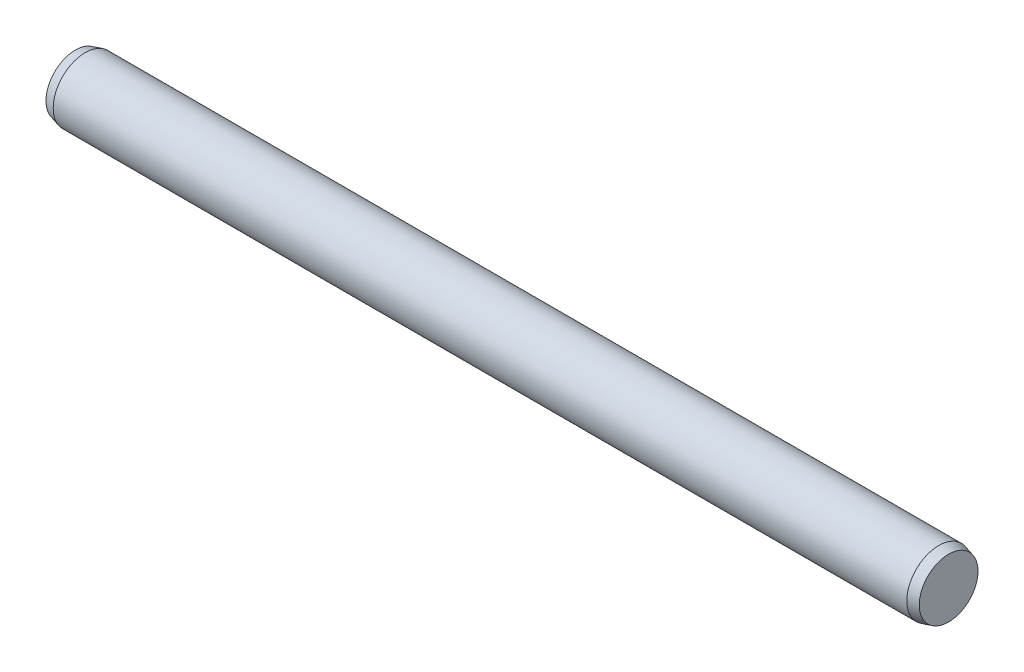
ISO-10303-21;
HEADER;
FILE_DESCRIPTION(('STEP AP214'),'2;1');
FILE_NAME('part.step','',(''),(''),'','','');
FILE_SCHEMA(('AUTOMOTIVE_DESIGN { 1 0 10303 214 1 1 1 1 }'));
ENDSEC;
DATA;
#1=APPLICATION_CONTEXT('core data for automotive mechanical design processes');
#2=APPLICATION_PROTOCOL_DEFINITION('international standard','automotive_design',2000,#1);
#3=PRODUCT_CONTEXT('',#1,'mechanical');
#4=PRODUCT('Part','Part','',(#3));
#5=PRODUCT_RELATED_PRODUCT_CATEGORY('part','',(#4));
#6=PRODUCT_DEFINITION_FORMATION('','',#4);
#7=PRODUCT_DEFINITION_CONTEXT('part definition',#1,'design');
#8=PRODUCT_DEFINITION('design','',#6,#7);
#9=PRODUCT_DEFINITION_SHAPE('','',#8);
#10=(LENGTH_UNIT() NAMED_UNIT(*) SI_UNIT(.MILLI.,.METRE.));
#11=(NAMED_UNIT(*) PLANE_ANGLE_UNIT() SI_UNIT($,.RADIAN.));
#12=(NAMED_UNIT(*) SI_UNIT($,.STERADIAN.) SOLID_ANGLE_UNIT());
#13=UNCERTAINTY_MEASURE_WITH_UNIT(LENGTH_MEASURE(1.E-05),#10,'distance_accuracy_value','');
#14=(GEOMETRIC_REPRESENTATION_CONTEXT(3) GLOBAL_UNCERTAINTY_ASSIGNED_CONTEXT((#13)) GLOBAL_UNIT_ASSIGNED_CONTEXT((#10,
#11,#12)) REPRESENTATION_CONTEXT('',''));
#15=CARTESIAN_POINT('',(0.,0.,0.));
#16=DIRECTION('',(0.,0.,1.));
#17=DIRECTION('',(1.,0.,0.));
#18=AXIS2_PLACEMENT_3D('',#15,#16,#17);
#19=CARTESIAN_POINT('',(-10.,0.,0.));
#20=DIRECTION('',(1.,0.,0.));
#21=DIRECTION('',(0.,0.,-1.));
#22=AXIS2_PLACEMENT_3D('',#19,#20,#21);
#23=CYLINDRICAL_SURFACE('',#22,0.750000000000002);
#24=CARTESIAN_POINT('',(-10.,0.,0.));
#25=DIRECTION('',(-1.,0.,0.));
#26=DIRECTION('',(0.,0.,1.));
#27=AXIS2_PLACEMENT_3D('',#24,#25,#26);
#28=CIRCLE('',#27,0.750000000000002);
#29=CARTESIAN_POINT('',(-10.,0.,0.750000000000002));
#30=VERTEX_POINT('',#29);
#31=EDGE_CURVE('E44',#30,#30,#28,.T.);
#32=ORIENTED_EDGE('',*,*,#31,.F.);
#33=EDGE_LOOP('',(#32));
#34=FACE_BOUND('',#33,.T.);
#35=CARTESIAN_POINT('',(10.,0.,0.));
#36=DIRECTION('',(1.,0.,0.));
#37=DIRECTION('',(0.,0.,-1.));
#38=AXIS2_PLACEMENT_3D('',#35,#36,#37);
#39=CIRCLE('',#38,0.750000000000002);
#40=CARTESIAN_POINT('',(10.,0.,-0.750000000000002));
#41=VERTEX_POINT('',#40);
#42=EDGE_CURVE('E10',#41,#41,#39,.T.);
#43=ORIENTED_EDGE('',*,*,#42,.F.);
#44=EDGE_LOOP('',(#43));
#45=FACE_BOUND('',#44,.T.);
#46=ADVANCED_FACE('F30',(#34,#45),#23,.T.);
#47=CARTESIAN_POINT('',(10.,0.,0.));
#48=DIRECTION('',(-1.,0.,0.));
#49=DIRECTION('',(0.,0.,-1.));
#50=AXIS2_PLACEMENT_3D('',#47,#48,#49);
#51=CONICAL_SURFACE('',#50,0.750000000000002,0.26179938779915);
#52=CARTESIAN_POINT('',(10.23,0.,0.));
#53=DIRECTION('',(1.,0.,0.));
#54=DIRECTION('',(0.,0.,-1.));
#55=AXIS2_PLACEMENT_3D('',#52,#53,#54);
#56=CIRCLE('',#55,0.688371685740845);
#57=CARTESIAN_POINT('',(10.23,0.,-0.688371685740845));
#58=VERTEX_POINT('',#57);
#59=EDGE_CURVE('E36',#58,#58,#56,.T.);
#60=ORIENTED_EDGE('',*,*,#59,.F.);
#61=EDGE_LOOP('',(#60));
#62=FACE_BOUND('',#61,.T.);
#63=ORIENTED_EDGE('',*,*,#42,.T.);
#64=EDGE_LOOP('',(#63));
#65=FACE_BOUND('',#64,.T.);
#66=ADVANCED_FACE('F54',(#62,#65),#51,.T.);
#67=CARTESIAN_POINT('',(10.23,0.,0.));
#68=DIRECTION('',(1.,0.,0.));
#69=DIRECTION('',(0.,0.,-1.));
#70=AXIS2_PLACEMENT_3D('',#67,#68,#69);
#71=PLANE('',#70);
#72=ORIENTED_EDGE('',*,*,#59,.T.);
#73=EDGE_LOOP('',(#72));
#74=FACE_BOUND('',#73,.T.);
#75=ADVANCED_FACE('F58',(#74),#71,.T.);
#76=CARTESIAN_POINT('',(-10.,0.,0.));
#77=DIRECTION('',(1.,0.,0.));
#78=DIRECTION('',(0.,0.,1.));
#79=AXIS2_PLACEMENT_3D('',#76,#77,#78);
#80=CONICAL_SURFACE('',#79,0.750000000000002,0.26179938779915);
#81=CARTESIAN_POINT('',(-10.23,0.,0.));
#82=DIRECTION('',(-1.,0.,0.));
#83=DIRECTION('',(0.,0.,1.));
#84=AXIS2_PLACEMENT_3D('',#81,#82,#83);
#85=CIRCLE('',#84,0.688371685740845);
#86=CARTESIAN_POINT('',(-10.23,0.,0.688371685740845));
#87=VERTEX_POINT('',#86);
#88=EDGE_CURVE('E40',#87,#87,#85,.T.);
#89=ORIENTED_EDGE('',*,*,#88,.F.);
#90=EDGE_LOOP('',(#89));
#91=FACE_BOUND('',#90,.T.);
#92=ORIENTED_EDGE('',*,*,#31,.T.);
#93=EDGE_LOOP('',(#92));
#94=FACE_BOUND('',#93,.T.);
#95=ADVANCED_FACE('F50',(#91,#94),#80,.T.);
#96=CARTESIAN_POINT('',(-10.23,0.,0.));
#97=DIRECTION('',(-1.,0.,0.));
#98=DIRECTION('',(0.,0.,1.));
#99=AXIS2_PLACEMENT_3D('',#96,#97,#98);
#100=PLANE('',#99);
#101=ORIENTED_EDGE('',*,*,#88,.T.);
#102=EDGE_LOOP('',(#101));
#103=FACE_BOUND('',#102,.T.);
#104=ADVANCED_FACE('F67',(#103),#100,.T.);
#105=CLOSED_SHELL('',(#46,#66,#75,#95,#104));
#106=MANIFOLD_SOLID_BREP('B2',#105);
#107=ADVANCED_BREP_SHAPE_REPRESENTATION('',(#18,#106),#14);
#108=SHAPE_DEFINITION_REPRESENTATION(#9,#107);
ENDSEC;
END-ISO-10303-21;
